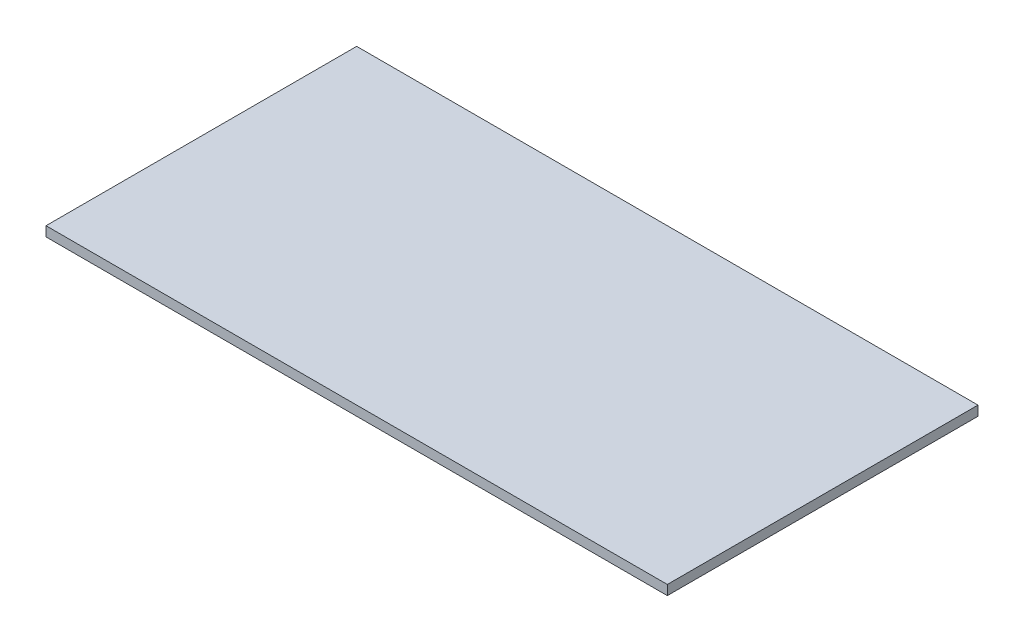
ISO-10303-21;
HEADER;
FILE_DESCRIPTION(('STEP AP214'),'2;1');
FILE_NAME('part.step','',(''),(''),'','','');
FILE_SCHEMA(('AUTOMOTIVE_DESIGN { 1 0 10303 214 1 1 1 1 }'));
ENDSEC;
DATA;
#1=APPLICATION_CONTEXT('core data for automotive mechanical design processes');
#2=APPLICATION_PROTOCOL_DEFINITION('international standard','automotive_design',2000,#1);
#3=PRODUCT_CONTEXT('',#1,'mechanical');
#4=PRODUCT('Part','Part','',(#3));
#5=PRODUCT_RELATED_PRODUCT_CATEGORY('part','',(#4));
#6=PRODUCT_DEFINITION_FORMATION('','',#4);
#7=PRODUCT_DEFINITION_CONTEXT('part definition',#1,'design');
#8=PRODUCT_DEFINITION('design','',#6,#7);
#9=PRODUCT_DEFINITION_SHAPE('','',#8);
#10=(LENGTH_UNIT() NAMED_UNIT(*) SI_UNIT(.MILLI.,.METRE.));
#11=(NAMED_UNIT(*) PLANE_ANGLE_UNIT() SI_UNIT($,.RADIAN.));
#12=(NAMED_UNIT(*) SI_UNIT($,.STERADIAN.) SOLID_ANGLE_UNIT());
#13=UNCERTAINTY_MEASURE_WITH_UNIT(LENGTH_MEASURE(1.E-05),#10,'distance_accuracy_value','');
#14=(GEOMETRIC_REPRESENTATION_CONTEXT(3) GLOBAL_UNCERTAINTY_ASSIGNED_CONTEXT((#13)) GLOBAL_UNIT_ASSIGNED_CONTEXT((#10,
#11,#12)) REPRESENTATION_CONTEXT('',''));
#15=CARTESIAN_POINT('',(0.,0.,0.));
#16=DIRECTION('',(0.,0.,1.));
#17=DIRECTION('',(1.,0.,0.));
#18=AXIS2_PLACEMENT_3D('',#15,#16,#17);
#19=CARTESIAN_POINT('',(-609.6,19.05,-304.8));
#20=DIRECTION('',(1.,0.,0.));
#21=DIRECTION('',(0.,0.,-1.));
#22=AXIS2_PLACEMENT_3D('',#19,#20,#21);
#23=PLANE('',#22);
#24=DIRECTION('',(0.,0.,1.));
#25=VECTOR('',#24,1.);
#26=CARTESIAN_POINT('',(-609.6,0.,-304.8));
#27=LINE('',#26,#25);
#28=CARTESIAN_POINT('',(-609.6,0.,-304.8));
#29=VERTEX_POINT('',#28);
#30=CARTESIAN_POINT('',(-609.6,0.,304.8));
#31=VERTEX_POINT('',#30);
#32=EDGE_CURVE('E113',#29,#31,#27,.T.);
#33=ORIENTED_EDGE('',*,*,#32,.T.);
#34=DIRECTION('',(0.,-1.,0.));
#35=VECTOR('',#34,1.);
#36=CARTESIAN_POINT('',(-609.6,19.05,304.8));
#37=LINE('',#36,#35);
#38=CARTESIAN_POINT('',(-609.6,19.05,304.8));
#39=VERTEX_POINT('',#38);
#40=EDGE_CURVE('E11',#39,#31,#37,.T.);
#41=ORIENTED_EDGE('',*,*,#40,.F.);
#42=DIRECTION('',(0.,0.,1.));
#43=VECTOR('',#42,1.);
#44=CARTESIAN_POINT('',(-609.6,19.05,-304.8));
#45=LINE('',#44,#43);
#46=CARTESIAN_POINT('',(-609.6,19.05,-304.8));
#47=VERTEX_POINT('',#46);
#48=EDGE_CURVE('E96',#47,#39,#45,.T.);
#49=ORIENTED_EDGE('',*,*,#48,.F.);
#50=DIRECTION('',(0.,-1.,0.));
#51=VECTOR('',#50,1.);
#52=CARTESIAN_POINT('',(-609.6,19.05,-304.8));
#53=LINE('',#52,#51);
#54=EDGE_CURVE('E109',#47,#29,#53,.T.);
#55=ORIENTED_EDGE('',*,*,#54,.T.);
#56=EDGE_LOOP('',(#33,#41,#49,#55));
#57=FACE_BOUND('',#56,.T.);
#58=ADVANCED_FACE('F39',(#57),#23,.F.);
#59=CARTESIAN_POINT('',(-609.6,19.05,304.8));
#60=DIRECTION('',(0.,0.,-1.));
#61=DIRECTION('',(-1.,0.,0.));
#62=AXIS2_PLACEMENT_3D('',#59,#60,#61);
#63=PLANE('',#62);
#64=DIRECTION('',(1.,0.,0.));
#65=VECTOR('',#64,1.);
#66=CARTESIAN_POINT('',(-609.6,0.,304.8));
#67=LINE('',#66,#65);
#68=CARTESIAN_POINT('',(609.6,0.,304.8));
#69=VERTEX_POINT('',#68);
#70=EDGE_CURVE('E101',#31,#69,#67,.T.);
#71=ORIENTED_EDGE('',*,*,#70,.T.);
#72=DIRECTION('',(0.,-1.,0.));
#73=VECTOR('',#72,1.);
#74=CARTESIAN_POINT('',(609.6,19.05,304.8));
#75=LINE('',#74,#73);
#76=CARTESIAN_POINT('',(609.6,19.05,304.8));
#77=VERTEX_POINT('',#76);
#78=EDGE_CURVE('E48',#77,#69,#75,.T.);
#79=ORIENTED_EDGE('',*,*,#78,.F.);
#80=DIRECTION('',(1.,0.,0.));
#81=VECTOR('',#80,1.);
#82=CARTESIAN_POINT('',(-609.6,19.05,304.8));
#83=LINE('',#82,#81);
#84=EDGE_CURVE('E90',#39,#77,#83,.T.);
#85=ORIENTED_EDGE('',*,*,#84,.F.);
#86=ORIENTED_EDGE('',*,*,#40,.T.);
#87=EDGE_LOOP('',(#71,#79,#85,#86));
#88=FACE_BOUND('',#87,.T.);
#89=ADVANCED_FACE('F100',(#88),#63,.F.);
#90=CARTESIAN_POINT('',(609.6,19.05,-304.8));
#91=DIRECTION('',(-1.,0.,0.));
#92=DIRECTION('',(0.,0.,1.));
#93=AXIS2_PLACEMENT_3D('',#90,#91,#92);
#94=PLANE('',#93);
#95=DIRECTION('',(0.,0.,-1.));
#96=VECTOR('',#95,1.);
#97=CARTESIAN_POINT('',(609.6,0.,-304.8));
#98=LINE('',#97,#96);
#99=CARTESIAN_POINT('',(609.6,0.,-304.8));
#100=VERTEX_POINT('',#99);
#101=EDGE_CURVE('E76',#69,#100,#98,.T.);
#102=ORIENTED_EDGE('',*,*,#101,.T.);
#103=DIRECTION('',(0.,-1.,0.));
#104=VECTOR('',#103,1.);
#105=CARTESIAN_POINT('',(609.6,19.05,-304.8));
#106=LINE('',#105,#104);
#107=CARTESIAN_POINT('',(609.6,19.05,-304.8));
#108=VERTEX_POINT('',#107);
#109=EDGE_CURVE('E103',#108,#100,#106,.T.);
#110=ORIENTED_EDGE('',*,*,#109,.F.);
#111=DIRECTION('',(0.,0.,-1.));
#112=VECTOR('',#111,1.);
#113=CARTESIAN_POINT('',(609.6,19.05,-304.8));
#114=LINE('',#113,#112);
#115=EDGE_CURVE('E94',#77,#108,#114,.T.);
#116=ORIENTED_EDGE('',*,*,#115,.F.);
#117=ORIENTED_EDGE('',*,*,#78,.T.);
#118=EDGE_LOOP('',(#102,#110,#116,#117));
#119=FACE_BOUND('',#118,.T.);
#120=ADVANCED_FACE('F104',(#119),#94,.F.);
#121=CARTESIAN_POINT('',(-609.6,19.05,-304.8));
#122=DIRECTION('',(0.,0.,1.));
#123=DIRECTION('',(1.,0.,0.));
#124=AXIS2_PLACEMENT_3D('',#121,#122,#123);
#125=PLANE('',#124);
#126=DIRECTION('',(-1.,0.,0.));
#127=VECTOR('',#126,1.);
#128=CARTESIAN_POINT('',(-609.6,0.,-304.8));
#129=LINE('',#128,#127);
#130=EDGE_CURVE('E82',#100,#29,#129,.T.);
#131=ORIENTED_EDGE('',*,*,#130,.T.);
#132=ORIENTED_EDGE('',*,*,#54,.F.);
#133=DIRECTION('',(-1.,0.,0.));
#134=VECTOR('',#133,1.);
#135=CARTESIAN_POINT('',(-609.6,19.05,-304.8));
#136=LINE('',#135,#134);
#137=EDGE_CURVE('E56',#108,#47,#136,.T.);
#138=ORIENTED_EDGE('',*,*,#137,.F.);
#139=ORIENTED_EDGE('',*,*,#109,.T.);
#140=EDGE_LOOP('',(#131,#132,#138,#139));
#141=FACE_BOUND('',#140,.T.);
#142=ADVANCED_FACE('F124',(#141),#125,.F.);
#143=CARTESIAN_POINT('',(0.,19.05,0.));
#144=DIRECTION('',(0.,1.,0.));
#145=DIRECTION('',(0.,0.,1.));
#146=AXIS2_PLACEMENT_3D('',#143,#144,#145);
#147=PLANE('',#146);
#148=ORIENTED_EDGE('',*,*,#48,.T.);
#149=ORIENTED_EDGE('',*,*,#84,.T.);
#150=ORIENTED_EDGE('',*,*,#115,.T.);
#151=ORIENTED_EDGE('',*,*,#137,.T.);
#152=EDGE_LOOP('',(#148,#149,#150,#151));
#153=FACE_BOUND('',#152,.T.);
#154=ADVANCED_FACE('F92',(#153),#147,.T.);
#155=CARTESIAN_POINT('',(0.,0.,0.));
#156=DIRECTION('',(0.,1.,0.));
#157=DIRECTION('',(0.,0.,1.));
#158=AXIS2_PLACEMENT_3D('',#155,#156,#157);
#159=PLANE('',#158);
#160=ORIENTED_EDGE('',*,*,#32,.F.);
#161=ORIENTED_EDGE('',*,*,#130,.F.);
#162=ORIENTED_EDGE('',*,*,#101,.F.);
#163=ORIENTED_EDGE('',*,*,#70,.F.);
#164=EDGE_LOOP('',(#160,#161,#162,#163));
#165=FACE_BOUND('',#164,.T.);
#166=ADVANCED_FACE('F127',(#165),#159,.F.);
#167=CLOSED_SHELL('',(#58,#89,#120,#142,#154,#166));
#168=MANIFOLD_SOLID_BREP('B2',#167);
#169=ADVANCED_BREP_SHAPE_REPRESENTATION('',(#18,#168),#14);
#170=SHAPE_DEFINITION_REPRESENTATION(#9,#169);
ENDSEC;
END-ISO-10303-21;
